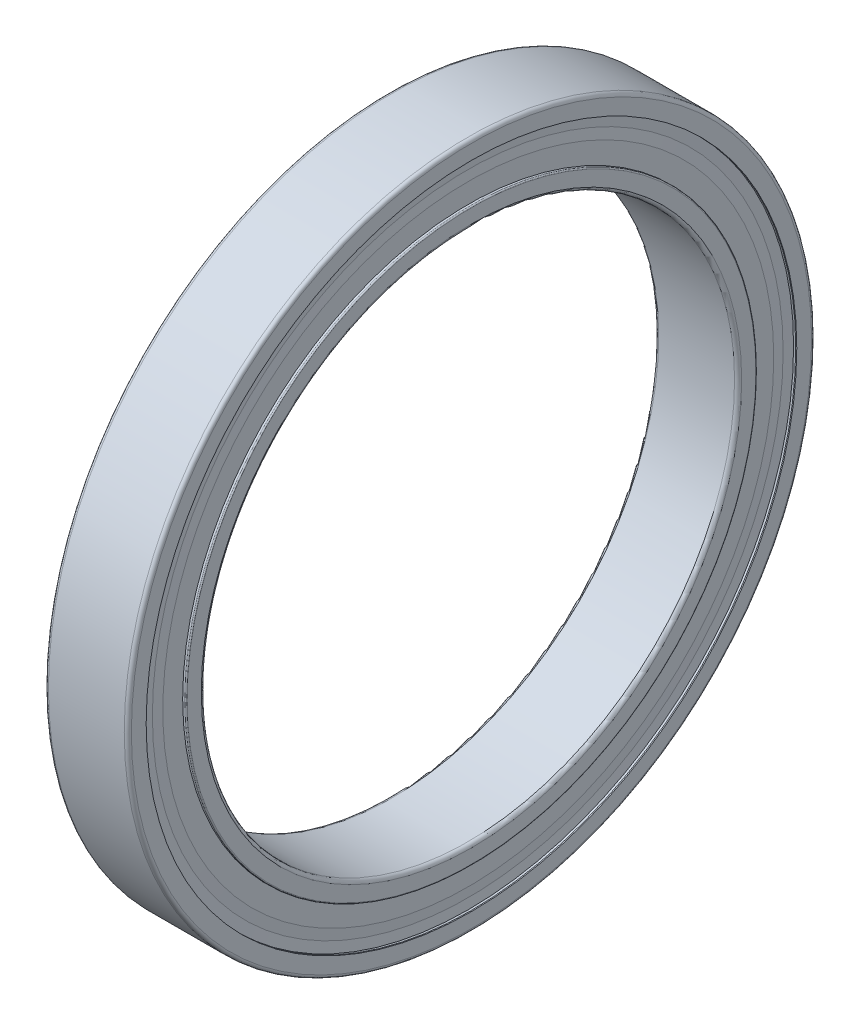
ISO-10303-21;
HEADER;
FILE_DESCRIPTION(('STEP AP214'),'2;1');
FILE_NAME('part.step','',(''),(''),'','','');
FILE_SCHEMA(('AUTOMOTIVE_DESIGN { 1 0 10303 214 1 1 1 1 }'));
ENDSEC;
DATA;
#1=APPLICATION_CONTEXT('core data for automotive mechanical design processes');
#2=APPLICATION_PROTOCOL_DEFINITION('international standard','automotive_design',2000,#1);
#3=PRODUCT_CONTEXT('',#1,'mechanical');
#4=PRODUCT('Part','Part','',(#3));
#5=PRODUCT_RELATED_PRODUCT_CATEGORY('part','',(#4));
#6=PRODUCT_DEFINITION_FORMATION('','',#4);
#7=PRODUCT_DEFINITION_CONTEXT('part definition',#1,'design');
#8=PRODUCT_DEFINITION('design','',#6,#7);
#9=PRODUCT_DEFINITION_SHAPE('','',#8);
#10=(LENGTH_UNIT() NAMED_UNIT(*) SI_UNIT(.MILLI.,.METRE.));
#11=(NAMED_UNIT(*) PLANE_ANGLE_UNIT() SI_UNIT($,.RADIAN.));
#12=(NAMED_UNIT(*) SI_UNIT($,.STERADIAN.) SOLID_ANGLE_UNIT());
#13=UNCERTAINTY_MEASURE_WITH_UNIT(LENGTH_MEASURE(1.E-05),#10,'distance_accuracy_value','');
#14=(GEOMETRIC_REPRESENTATION_CONTEXT(3) GLOBAL_UNCERTAINTY_ASSIGNED_CONTEXT((#13)) GLOBAL_UNIT_ASSIGNED_CONTEXT((#10,
#11,#12)) REPRESENTATION_CONTEXT('',''));
#15=CARTESIAN_POINT('',(0.,0.,0.));
#16=DIRECTION('',(0.,0.,1.));
#17=DIRECTION('',(1.,0.,0.));
#18=AXIS2_PLACEMENT_3D('',#15,#16,#17);
#19=CARTESIAN_POINT('',(6.64,0.,0.));
#20=DIRECTION('',(1.,0.,0.));
#21=DIRECTION('',(0.,0.,-1.));
#22=AXIS2_PLACEMENT_3D('',#19,#20,#21);
#23=CONICAL_SURFACE('',#22,27.45,1.4637444653);
#24=CARTESIAN_POINT('',(6.64,0.,0.));
#25=DIRECTION('',(1.,0.,0.));
#26=DIRECTION('',(0.,0.,-1.));
#27=AXIS2_PLACEMENT_3D('',#24,#25,#26);
#28=CIRCLE('',#27,27.45);
#29=CARTESIAN_POINT('',(6.64,0.,-27.45));
#30=VERTEX_POINT('',#29);
#31=EDGE_CURVE('P0_E39',#30,#30,#28,.T.);
#32=ORIENTED_EDGE('',*,*,#31,.F.);
#33=EDGE_LOOP('',(#32));
#34=FACE_BOUND('',#33,.T.);
#35=CARTESIAN_POINT('',(6.55,0.,0.));
#36=DIRECTION('',(1.,0.,0.));
#37=DIRECTION('',(0.,0.,-1.));
#38=AXIS2_PLACEMENT_3D('',#35,#36,#37);
#39=CIRCLE('',#38,26.6125);
#40=CARTESIAN_POINT('',(6.55,0.,-26.6125));
#41=VERTEX_POINT('',#40);
#42=EDGE_CURVE('P0_E11',#41,#41,#39,.T.);
#43=ORIENTED_EDGE('',*,*,#42,.T.);
#44=EDGE_LOOP('',(#43));
#45=FACE_BOUND('',#44,.T.);
#46=ADVANCED_FACE('P0_F16',(#34,#45),#23,.T.);
#47=CARTESIAN_POINT('',(6.55,26.6125,0.));
#48=DIRECTION('',(-1.,0.,0.));
#49=DIRECTION('',(0.,0.,1.));
#50=AXIS2_PLACEMENT_3D('',#47,#48,#49);
#51=PLANE('',#50);
#52=ORIENTED_EDGE('',*,*,#42,.F.);
#53=EDGE_LOOP('',(#52));
#54=FACE_BOUND('',#53,.T.);
#55=CARTESIAN_POINT('',(6.55,0.,0.));
#56=DIRECTION('',(1.,0.,0.));
#57=DIRECTION('',(0.,0.,-1.));
#58=AXIS2_PLACEMENT_3D('',#55,#56,#57);
#59=CIRCLE('',#58,25.775);
#60=CARTESIAN_POINT('',(6.55,0.,-25.775));
#61=VERTEX_POINT('',#60);
#62=EDGE_CURVE('P0_E27',#61,#61,#59,.T.);
#63=ORIENTED_EDGE('',*,*,#62,.T.);
#64=EDGE_LOOP('',(#63));
#65=FACE_BOUND('',#64,.T.);
#66=ADVANCED_FACE('P0_F249',(#54,#65),#51,.T.);
#67=CARTESIAN_POINT('',(0.45,0.,0.));
#68=DIRECTION('',(-1.,0.,0.));
#69=DIRECTION('',(0.,0.,1.));
#70=AXIS2_PLACEMENT_3D('',#67,#68,#69);
#71=CONICAL_SURFACE('',#70,26.6125,1.4637444653);
#72=CARTESIAN_POINT('',(0.36,0.,0.));
#73=DIRECTION('',(1.,0.,0.));
#74=DIRECTION('',(0.,0.,-1.));
#75=AXIS2_PLACEMENT_3D('',#72,#73,#74);
#76=CIRCLE('',#75,27.45);
#77=CARTESIAN_POINT('',(0.36,0.,-27.45));
#78=VERTEX_POINT('',#77);
#79=EDGE_CURVE('P0_E167',#78,#78,#76,.T.);
#80=ORIENTED_EDGE('',*,*,#79,.T.);
#81=EDGE_LOOP('',(#80));
#82=FACE_BOUND('',#81,.T.);
#83=CARTESIAN_POINT('',(0.45,0.,0.));
#84=DIRECTION('',(1.,0.,0.));
#85=DIRECTION('',(0.,0.,-1.));
#86=AXIS2_PLACEMENT_3D('',#83,#84,#85);
#87=CIRCLE('',#86,26.6125);
#88=CARTESIAN_POINT('',(0.45,0.,-26.6125));
#89=VERTEX_POINT('',#88);
#90=EDGE_CURVE('P0_E176',#89,#89,#87,.T.);
#91=ORIENTED_EDGE('',*,*,#90,.F.);
#92=EDGE_LOOP('',(#91));
#93=FACE_BOUND('',#92,.T.);
#94=ADVANCED_FACE('P0_F254',(#82,#93),#71,.T.);
#95=CARTESIAN_POINT('',(50.,0.,0.));
#96=DIRECTION('',(-1.,0.,0.));
#97=DIRECTION('',(0.,0.,-1.));
#98=AXIS2_PLACEMENT_3D('',#95,#96,#97);
#99=CYLINDRICAL_SURFACE('',#98,24.1);
#100=CARTESIAN_POINT('',(6.64,0.,0.));
#101=DIRECTION('',(1.,0.,0.));
#102=DIRECTION('',(0.,0.,-1.));
#103=AXIS2_PLACEMENT_3D('',#100,#101,#102);
#104=CIRCLE('',#103,24.1);
#105=CARTESIAN_POINT('',(6.64,0.,-24.1));
#106=VERTEX_POINT('',#105);
#107=EDGE_CURVE('P0_E149',#106,#106,#104,.T.);
#108=ORIENTED_EDGE('',*,*,#107,.F.);
#109=EDGE_LOOP('',(#108));
#110=FACE_BOUND('',#109,.T.);
#111=CARTESIAN_POINT('',(4.90649928901511,0.,0.));
#112=DIRECTION('',(1.,0.,0.));
#113=DIRECTION('',(0.,0.,-1.));
#114=AXIS2_PLACEMENT_3D('',#111,#112,#113);
#115=CIRCLE('',#114,24.1);
#116=CARTESIAN_POINT('',(4.90649928901511,0.,-24.1));
#117=VERTEX_POINT('',#116);
#118=EDGE_CURVE('P0_E163',#117,#117,#115,.T.);
#119=ORIENTED_EDGE('',*,*,#118,.T.);
#120=EDGE_LOOP('',(#119));
#121=FACE_BOUND('',#120,.T.);
#122=ADVANCED_FACE('P0_F300',(#110,#121),#99,.T.);
#123=CARTESIAN_POINT('',(50.,0.,0.));
#124=DIRECTION('',(-1.,0.,0.));
#125=DIRECTION('',(0.,0.,-1.));
#126=AXIS2_PLACEMENT_3D('',#123,#124,#125);
#127=CYLINDRICAL_SURFACE('',#126,24.1);
#128=CARTESIAN_POINT('',(0.27,0.,0.));
#129=DIRECTION('',(1.,0.,0.));
#130=DIRECTION('',(0.,0.,-1.));
#131=AXIS2_PLACEMENT_3D('',#128,#129,#130);
#132=CIRCLE('',#131,24.1);
#133=CARTESIAN_POINT('',(0.27,0.,-24.1));
#134=VERTEX_POINT('',#133);
#135=EDGE_CURVE('P0_E189',#134,#134,#132,.T.);
#136=ORIENTED_EDGE('',*,*,#135,.F.);
#137=EDGE_LOOP('',(#136));
#138=FACE_BOUND('',#137,.T.);
#139=CARTESIAN_POINT('',(0.100000000000003,0.,0.));
#140=DIRECTION('',(1.,0.,0.));
#141=DIRECTION('',(0.,0.,-1.));
#142=AXIS2_PLACEMENT_3D('',#139,#140,#141);
#143=CIRCLE('',#142,24.1);
#144=CARTESIAN_POINT('',(0.100000000000003,0.,-24.1));
#145=VERTEX_POINT('',#144);
#146=EDGE_CURVE('P0_E168',#145,#145,#143,.T.);
#147=ORIENTED_EDGE('',*,*,#146,.T.);
#148=EDGE_LOOP('',(#147));
#149=FACE_BOUND('',#148,.T.);
#150=ADVANCED_FACE('P0_F293',(#138,#149),#127,.T.);
#151=CARTESIAN_POINT('',(50.,0.,0.));
#152=DIRECTION('',(-1.,0.,0.));
#153=DIRECTION('',(0.,0.,-1.));
#154=AXIS2_PLACEMENT_3D('',#151,#152,#153);
#155=CYLINDRICAL_SURFACE('',#154,24.1);
#156=CARTESIAN_POINT('',(6.9,0.,0.));
#157=DIRECTION('',(1.,0.,0.));
#158=DIRECTION('',(0.,0.,-1.));
#159=AXIS2_PLACEMENT_3D('',#156,#157,#158);
#160=CIRCLE('',#159,24.1);
#161=CARTESIAN_POINT('',(6.9,0.,-24.1));
#162=VERTEX_POINT('',#161);
#163=EDGE_CURVE('P0_E130',#162,#162,#160,.T.);
#164=ORIENTED_EDGE('',*,*,#163,.F.);
#165=EDGE_LOOP('',(#164));
#166=FACE_BOUND('',#165,.T.);
#167=CARTESIAN_POINT('',(6.73,0.,0.));
#168=DIRECTION('',(1.,0.,0.));
#169=DIRECTION('',(0.,0.,-1.));
#170=AXIS2_PLACEMENT_3D('',#167,#168,#169);
#171=CIRCLE('',#170,24.1);
#172=CARTESIAN_POINT('',(6.73,0.,-24.1));
#173=VERTEX_POINT('',#172);
#174=EDGE_CURVE('P0_E142',#173,#173,#171,.T.);
#175=ORIENTED_EDGE('',*,*,#174,.T.);
#176=EDGE_LOOP('',(#175));
#177=FACE_BOUND('',#176,.T.);
#178=ADVANCED_FACE('P0_F131',(#166,#177),#155,.T.);
#179=CARTESIAN_POINT('',(3.5,0.,0.));
#180=DIRECTION('',(1.,0.,0.));
#181=DIRECTION('',(0.,0.,-1.));
#182=AXIS2_PLACEMENT_3D('',#179,#180,#181);
#183=TOROIDAL_SURFACE('',#182,25.5,1.9845);
#184=CARTESIAN_POINT('',(2.09350071098489,0.,0.));
#185=DIRECTION('',(1.,0.,0.));
#186=DIRECTION('',(0.,0.,-1.));
#187=AXIS2_PLACEMENT_3D('',#184,#185,#186);
#188=CIRCLE('',#187,24.1);
#189=CARTESIAN_POINT('',(2.09350071098489,0.,-24.1));
#190=VERTEX_POINT('',#189);
#191=EDGE_CURVE('P0_E135',#190,#190,#188,.T.);
#192=ORIENTED_EDGE('',*,*,#191,.T.);
#193=EDGE_LOOP('',(#192));
#194=FACE_BOUND('',#193,.T.);
#195=ORIENTED_EDGE('',*,*,#118,.F.);
#196=EDGE_LOOP('',(#195));
#197=FACE_BOUND('',#196,.T.);
#198=ADVANCED_FACE('P0_F243',(#194,#197),#183,.F.);
#199=CARTESIAN_POINT('',(6.9,0.,0.));
#200=DIRECTION('',(1.,0.,0.));
#201=DIRECTION('',(0.,0.,-1.));
#202=AXIS2_PLACEMENT_3D('',#199,#200,#201);
#203=TOROIDAL_SURFACE('',#202,24.,0.1);
#204=CARTESIAN_POINT('',(7.,0.,0.));
#205=DIRECTION('',(1.,0.,0.));
#206=DIRECTION('',(0.,0.,-1.));
#207=AXIS2_PLACEMENT_3D('',#204,#205,#206);
#208=CIRCLE('',#207,24.);
#209=CARTESIAN_POINT('',(7.,0.,-24.));
#210=VERTEX_POINT('',#209);
#211=EDGE_CURVE('P0_E136',#210,#210,#208,.T.);
#212=ORIENTED_EDGE('',*,*,#211,.F.);
#213=EDGE_LOOP('',(#212));
#214=FACE_BOUND('',#213,.T.);
#215=ORIENTED_EDGE('',*,*,#163,.T.);
#216=EDGE_LOOP('',(#215));
#217=FACE_BOUND('',#216,.T.);
#218=ADVANCED_FACE('P0_F232',(#214,#217),#203,.T.);
#219=CARTESIAN_POINT('',(7.,22.8,0.));
#220=DIRECTION('',(1.,0.,0.));
#221=DIRECTION('',(0.,1.,0.));
#222=AXIS2_PLACEMENT_3D('',#219,#220,#221);
#223=PLANE('',#222);
#224=ORIENTED_EDGE('',*,*,#211,.T.);
#225=EDGE_LOOP('',(#224));
#226=FACE_BOUND('',#225,.T.);
#227=CARTESIAN_POINT('',(7.,0.,0.));
#228=DIRECTION('',(1.,0.,0.));
#229=DIRECTION('',(0.,0.,-1.));
#230=AXIS2_PLACEMENT_3D('',#227,#228,#229);
#231=CIRCLE('',#230,22.8);
#232=CARTESIAN_POINT('',(7.,0.,-22.8));
#233=VERTEX_POINT('',#232);
#234=EDGE_CURVE('P0_E146',#233,#233,#231,.T.);
#235=ORIENTED_EDGE('',*,*,#234,.F.);
#236=EDGE_LOOP('',(#235));
#237=FACE_BOUND('',#236,.T.);
#238=ADVANCED_FACE('P0_F230',(#226,#237),#223,.T.);
#239=CARTESIAN_POINT('',(6.7,0.,0.));
#240=DIRECTION('',(1.,0.,0.));
#241=DIRECTION('',(0.,0.,-1.));
#242=AXIS2_PLACEMENT_3D('',#239,#240,#241);
#243=TOROIDAL_SURFACE('',#242,22.8,0.3);
#244=CARTESIAN_POINT('',(6.7,0.,0.));
#245=DIRECTION('',(1.,0.,0.));
#246=DIRECTION('',(0.,0.,-1.));
#247=AXIS2_PLACEMENT_3D('',#244,#245,#246);
#248=CIRCLE('',#247,22.5);
#249=CARTESIAN_POINT('',(6.7,0.,-22.5));
#250=VERTEX_POINT('',#249);
#251=EDGE_CURVE('P0_E154',#250,#250,#248,.T.);
#252=ORIENTED_EDGE('',*,*,#251,.F.);
#253=EDGE_LOOP('',(#252));
#254=FACE_BOUND('',#253,.T.);
#255=ORIENTED_EDGE('',*,*,#234,.T.);
#256=EDGE_LOOP('',(#255));
#257=FACE_BOUND('',#256,.T.);
#258=ADVANCED_FACE('P0_F228',(#254,#257),#243,.T.);
#259=CARTESIAN_POINT('',(50.,0.,0.));
#260=DIRECTION('',(-1.,0.,0.));
#261=DIRECTION('',(0.,0.,-1.));
#262=AXIS2_PLACEMENT_3D('',#259,#260,#261);
#263=CYLINDRICAL_SURFACE('',#262,22.5);
#264=CARTESIAN_POINT('',(0.3,0.,0.));
#265=DIRECTION('',(1.,0.,0.));
#266=DIRECTION('',(0.,0.,-1.));
#267=AXIS2_PLACEMENT_3D('',#264,#265,#266);
#268=CIRCLE('',#267,22.5);
#269=CARTESIAN_POINT('',(0.3,0.,-22.5));
#270=VERTEX_POINT('',#269);
#271=EDGE_CURVE('P0_E158',#270,#270,#268,.T.);
#272=ORIENTED_EDGE('',*,*,#271,.F.);
#273=EDGE_LOOP('',(#272));
#274=FACE_BOUND('',#273,.T.);
#275=ORIENTED_EDGE('',*,*,#251,.T.);
#276=EDGE_LOOP('',(#275));
#277=FACE_BOUND('',#276,.T.);
#278=ADVANCED_FACE('P0_F240',(#274,#277),#263,.F.);
#279=CARTESIAN_POINT('',(0.3,0.,0.));
#280=DIRECTION('',(1.,0.,0.));
#281=DIRECTION('',(0.,0.,-1.));
#282=AXIS2_PLACEMENT_3D('',#279,#280,#281);
#283=TOROIDAL_SURFACE('',#282,22.8,0.3);
#284=CARTESIAN_POINT('',(0.,0.,0.));
#285=DIRECTION('',(1.,0.,0.));
#286=DIRECTION('',(0.,0.,-1.));
#287=AXIS2_PLACEMENT_3D('',#284,#285,#286);
#288=CIRCLE('',#287,22.8);
#289=CARTESIAN_POINT('',(0.,0.,-22.8));
#290=VERTEX_POINT('',#289);
#291=EDGE_CURVE('P0_E162',#290,#290,#288,.T.);
#292=ORIENTED_EDGE('',*,*,#291,.F.);
#293=EDGE_LOOP('',(#292));
#294=FACE_BOUND('',#293,.T.);
#295=ORIENTED_EDGE('',*,*,#271,.T.);
#296=EDGE_LOOP('',(#295));
#297=FACE_BOUND('',#296,.T.);
#298=ADVANCED_FACE('P0_F259',(#294,#297),#283,.T.);
#299=CARTESIAN_POINT('',(0.,24.,0.));
#300=DIRECTION('',(-1.,0.,0.));
#301=DIRECTION('',(0.,0.,1.));
#302=AXIS2_PLACEMENT_3D('',#299,#300,#301);
#303=PLANE('',#302);
#304=CARTESIAN_POINT('',(0.,0.,0.));
#305=DIRECTION('',(1.,0.,0.));
#306=DIRECTION('',(0.,0.,-1.));
#307=AXIS2_PLACEMENT_3D('',#304,#305,#306);
#308=CIRCLE('',#307,24.);
#309=CARTESIAN_POINT('',(0.,0.,-24.));
#310=VERTEX_POINT('',#309);
#311=EDGE_CURVE('P0_E20',#310,#310,#308,.T.);
#312=ORIENTED_EDGE('',*,*,#311,.F.);
#313=EDGE_LOOP('',(#312));
#314=FACE_BOUND('',#313,.T.);
#315=ORIENTED_EDGE('',*,*,#291,.T.);
#316=EDGE_LOOP('',(#315));
#317=FACE_BOUND('',#316,.T.);
#318=ADVANCED_FACE('P0_F18',(#314,#317),#303,.T.);
#319=CARTESIAN_POINT('',(0.100000000000007,0.,0.));
#320=DIRECTION('',(1.,0.,0.));
#321=DIRECTION('',(0.,0.,-1.));
#322=AXIS2_PLACEMENT_3D('',#319,#320,#321);
#323=TOROIDAL_SURFACE('',#322,24.,0.1);
#324=ORIENTED_EDGE('',*,*,#146,.F.);
#325=EDGE_LOOP('',(#324));
#326=FACE_BOUND('',#325,.T.);
#327=ORIENTED_EDGE('',*,*,#311,.T.);
#328=EDGE_LOOP('',(#327));
#329=FACE_BOUND('',#328,.T.);
#330=ADVANCED_FACE('P0_F340',(#326,#329),#323,.T.);
#331=CARTESIAN_POINT('',(0.27,25.775,0.));
#332=DIRECTION('',(-1.,0.,0.));
#333=DIRECTION('',(0.,0.,1.));
#334=AXIS2_PLACEMENT_3D('',#331,#332,#333);
#335=PLANE('',#334);
#336=CARTESIAN_POINT('',(0.27,0.,0.));
#337=DIRECTION('',(1.,0.,0.));
#338=DIRECTION('',(0.,0.,-1.));
#339=AXIS2_PLACEMENT_3D('',#336,#337,#338);
#340=CIRCLE('',#339,25.775);
#341=CARTESIAN_POINT('',(0.27,0.,-25.775));
#342=VERTEX_POINT('',#341);
#343=EDGE_CURVE('P0_E185',#342,#342,#340,.T.);
#344=ORIENTED_EDGE('',*,*,#343,.F.);
#345=EDGE_LOOP('',(#344));
#346=FACE_BOUND('',#345,.T.);
#347=ORIENTED_EDGE('',*,*,#135,.T.);
#348=EDGE_LOOP('',(#347));
#349=FACE_BOUND('',#348,.T.);
#350=ADVANCED_FACE('P0_F266',(#346,#349),#335,.T.);
#351=CARTESIAN_POINT('',(0.315,0.,0.));
#352=DIRECTION('',(1.,0.,0.));
#353=DIRECTION('',(0.,0.,-1.));
#354=AXIS2_PLACEMENT_3D('',#351,#352,#353);
#355=CONICAL_SURFACE('',#354,26.6125,1.5171166026);
#356=CARTESIAN_POINT('',(0.315,0.,0.));
#357=DIRECTION('',(1.,0.,0.));
#358=DIRECTION('',(0.,0.,-1.));
#359=AXIS2_PLACEMENT_3D('',#356,#357,#358);
#360=CIRCLE('',#359,26.6125);
#361=CARTESIAN_POINT('',(0.315,0.,-26.6125));
#362=VERTEX_POINT('',#361);
#363=EDGE_CURVE('P0_E181',#362,#362,#360,.T.);
#364=ORIENTED_EDGE('',*,*,#363,.F.);
#365=EDGE_LOOP('',(#364));
#366=FACE_BOUND('',#365,.T.);
#367=ORIENTED_EDGE('',*,*,#343,.T.);
#368=EDGE_LOOP('',(#367));
#369=FACE_BOUND('',#368,.T.);
#370=ADVANCED_FACE('P0_F262',(#366,#369),#355,.T.);
#371=CARTESIAN_POINT('',(0.27,0.,0.));
#372=DIRECTION('',(-1.,0.,0.));
#373=DIRECTION('',(0.,0.,1.));
#374=AXIS2_PLACEMENT_3D('',#371,#372,#373);
#375=CONICAL_SURFACE('',#374,27.45,1.5171166026);
#376=CARTESIAN_POINT('',(0.27,0.,0.));
#377=DIRECTION('',(1.,0.,0.));
#378=DIRECTION('',(0.,0.,-1.));
#379=AXIS2_PLACEMENT_3D('',#376,#377,#378);
#380=CIRCLE('',#379,27.45);
#381=CARTESIAN_POINT('',(0.27,0.,-27.45));
#382=VERTEX_POINT('',#381);
#383=EDGE_CURVE('P0_E178',#382,#382,#380,.T.);
#384=ORIENTED_EDGE('',*,*,#383,.F.);
#385=EDGE_LOOP('',(#384));
#386=FACE_BOUND('',#385,.T.);
#387=ORIENTED_EDGE('',*,*,#363,.T.);
#388=EDGE_LOOP('',(#387));
#389=FACE_BOUND('',#388,.T.);
#390=ADVANCED_FACE('P0_F265',(#386,#389),#375,.F.);
#391=CARTESIAN_POINT('',(50.,0.,0.));
#392=DIRECTION('',(-1.,0.,0.));
#393=DIRECTION('',(0.,0.,-1.));
#394=AXIS2_PLACEMENT_3D('',#391,#392,#393);
#395=CYLINDRICAL_SURFACE('',#394,27.45);
#396=ORIENTED_EDGE('',*,*,#79,.F.);
#397=EDGE_LOOP('',(#396));
#398=FACE_BOUND('',#397,.T.);
#399=ORIENTED_EDGE('',*,*,#383,.T.);
#400=EDGE_LOOP('',(#399));
#401=FACE_BOUND('',#400,.T.);
#402=ADVANCED_FACE('P0_F272',(#398,#401),#395,.T.);
#403=CARTESIAN_POINT('',(0.45,25.775,0.));
#404=DIRECTION('',(1.,0.,0.));
#405=DIRECTION('',(0.,1.,0.));
#406=AXIS2_PLACEMENT_3D('',#403,#404,#405);
#407=PLANE('',#406);
#408=ORIENTED_EDGE('',*,*,#90,.T.);
#409=EDGE_LOOP('',(#408));
#410=FACE_BOUND('',#409,.T.);
#411=CARTESIAN_POINT('',(0.45,0.,0.));
#412=DIRECTION('',(1.,0.,0.));
#413=DIRECTION('',(0.,0.,-1.));
#414=AXIS2_PLACEMENT_3D('',#411,#412,#413);
#415=CIRCLE('',#414,25.775);
#416=CARTESIAN_POINT('',(0.45,0.,-25.775));
#417=VERTEX_POINT('',#416);
#418=EDGE_CURVE('P0_E172',#417,#417,#415,.T.);
#419=ORIENTED_EDGE('',*,*,#418,.F.);
#420=EDGE_LOOP('',(#419));
#421=FACE_BOUND('',#420,.T.);
#422=ADVANCED_FACE('P0_F268',(#410,#421),#407,.T.);
#423=CARTESIAN_POINT('',(0.36,0.,0.));
#424=DIRECTION('',(1.,0.,0.));
#425=DIRECTION('',(0.,0.,-1.));
#426=AXIS2_PLACEMENT_3D('',#423,#424,#425);
#427=CONICAL_SURFACE('',#426,24.1,1.5171166026);
#428=ORIENTED_EDGE('',*,*,#418,.T.);
#429=EDGE_LOOP('',(#428));
#430=FACE_BOUND('',#429,.T.);
#431=CARTESIAN_POINT('',(0.36,0.,0.));
#432=DIRECTION('',(1.,0.,0.));
#433=DIRECTION('',(0.,0.,-1.));
#434=AXIS2_PLACEMENT_3D('',#431,#432,#433);
#435=CIRCLE('',#434,24.1);
#436=CARTESIAN_POINT('',(0.36,0.,-24.1));
#437=VERTEX_POINT('',#436);
#438=EDGE_CURVE('P0_E177',#437,#437,#435,.T.);
#439=ORIENTED_EDGE('',*,*,#438,.F.);
#440=EDGE_LOOP('',(#439));
#441=FACE_BOUND('',#440,.T.);
#442=ADVANCED_FACE('P0_F271',(#430,#441),#427,.F.);
#443=CARTESIAN_POINT('',(50.,0.,0.));
#444=DIRECTION('',(-1.,0.,0.));
#445=DIRECTION('',(0.,0.,-1.));
#446=AXIS2_PLACEMENT_3D('',#443,#444,#445);
#447=CYLINDRICAL_SURFACE('',#446,24.1);
#448=ORIENTED_EDGE('',*,*,#191,.F.);
#449=EDGE_LOOP('',(#448));
#450=FACE_BOUND('',#449,.T.);
#451=ORIENTED_EDGE('',*,*,#438,.T.);
#452=EDGE_LOOP('',(#451));
#453=FACE_BOUND('',#452,.T.);
#454=ADVANCED_FACE('P0_F275',(#450,#453),#447,.T.);
#455=CARTESIAN_POINT('',(6.73,24.1,0.));
#456=DIRECTION('',(1.,0.,0.));
#457=DIRECTION('',(0.,1.,0.));
#458=AXIS2_PLACEMENT_3D('',#455,#456,#457);
#459=PLANE('',#458);
#460=CARTESIAN_POINT('',(6.73,0.,0.));
#461=DIRECTION('',(1.,0.,0.));
#462=DIRECTION('',(0.,0.,-1.));
#463=AXIS2_PLACEMENT_3D('',#460,#461,#462);
#464=CIRCLE('',#463,25.775);
#465=CARTESIAN_POINT('',(6.73,0.,-25.775));
#466=VERTEX_POINT('',#465);
#467=EDGE_CURVE('P0_E205',#466,#466,#464,.T.);
#468=ORIENTED_EDGE('',*,*,#467,.T.);
#469=EDGE_LOOP('',(#468));
#470=FACE_BOUND('',#469,.T.);
#471=ORIENTED_EDGE('',*,*,#174,.F.);
#472=EDGE_LOOP('',(#471));
#473=FACE_BOUND('',#472,.T.);
#474=ADVANCED_FACE('P0_F277',(#470,#473),#459,.T.);
#475=CARTESIAN_POINT('',(6.73,0.,0.));
#476=DIRECTION('',(-1.,0.,0.));
#477=DIRECTION('',(0.,0.,1.));
#478=AXIS2_PLACEMENT_3D('',#475,#476,#477);
#479=CONICAL_SURFACE('',#478,25.775,1.5171166026);
#480=CARTESIAN_POINT('',(6.685,0.,0.));
#481=DIRECTION('',(1.,0.,0.));
#482=DIRECTION('',(0.,0.,-1.));
#483=AXIS2_PLACEMENT_3D('',#480,#481,#482);
#484=CIRCLE('',#483,26.6125);
#485=CARTESIAN_POINT('',(6.685,0.,-26.6125));
#486=VERTEX_POINT('',#485);
#487=EDGE_CURVE('P0_E152',#486,#486,#484,.T.);
#488=ORIENTED_EDGE('',*,*,#487,.T.);
#489=EDGE_LOOP('',(#488));
#490=FACE_BOUND('',#489,.T.);
#491=ORIENTED_EDGE('',*,*,#467,.F.);
#492=EDGE_LOOP('',(#491));
#493=FACE_BOUND('',#492,.T.);
#494=ADVANCED_FACE('P0_F279',(#490,#493),#479,.T.);
#495=CARTESIAN_POINT('',(6.55,0.,0.));
#496=DIRECTION('',(-1.,0.,0.));
#497=DIRECTION('',(0.,0.,1.));
#498=AXIS2_PLACEMENT_3D('',#495,#496,#497);
#499=CONICAL_SURFACE('',#498,25.775,1.5171166026);
#500=ORIENTED_EDGE('',*,*,#62,.F.);
#501=EDGE_LOOP('',(#500));
#502=FACE_BOUND('',#501,.T.);
#503=ORIENTED_EDGE('',*,*,#107,.T.);
#504=EDGE_LOOP('',(#503));
#505=FACE_BOUND('',#504,.T.);
#506=ADVANCED_FACE('P0_F285',(#502,#505),#499,.F.);
#507=CARTESIAN_POINT('',(6.685,0.,0.));
#508=DIRECTION('',(1.,0.,0.));
#509=DIRECTION('',(0.,0.,-1.));
#510=AXIS2_PLACEMENT_3D('',#507,#508,#509);
#511=CONICAL_SURFACE('',#510,26.6125,1.5171166026);
#512=CARTESIAN_POINT('',(6.73,0.,0.));
#513=DIRECTION('',(1.,0.,0.));
#514=DIRECTION('',(0.,0.,-1.));
#515=AXIS2_PLACEMENT_3D('',#512,#513,#514);
#516=CIRCLE('',#515,27.45);
#517=CARTESIAN_POINT('',(6.73,0.,-27.45));
#518=VERTEX_POINT('',#517);
#519=EDGE_CURVE('P0_E153',#518,#518,#516,.T.);
#520=ORIENTED_EDGE('',*,*,#519,.T.);
#521=EDGE_LOOP('',(#520));
#522=FACE_BOUND('',#521,.T.);
#523=ORIENTED_EDGE('',*,*,#487,.F.);
#524=EDGE_LOOP('',(#523));
#525=FACE_BOUND('',#524,.T.);
#526=ADVANCED_FACE('P0_F306',(#522,#525),#511,.F.);
#527=CARTESIAN_POINT('',(50.,0.,0.));
#528=DIRECTION('',(-1.,0.,0.));
#529=DIRECTION('',(0.,0.,-1.));
#530=AXIS2_PLACEMENT_3D('',#527,#528,#529);
#531=CYLINDRICAL_SURFACE('',#530,27.45);
#532=ORIENTED_EDGE('',*,*,#519,.F.);
#533=EDGE_LOOP('',(#532));
#534=FACE_BOUND('',#533,.T.);
#535=ORIENTED_EDGE('',*,*,#31,.T.);
#536=EDGE_LOOP('',(#535));
#537=FACE_BOUND('',#536,.T.);
#538=ADVANCED_FACE('P0_F308',(#534,#537),#531,.T.);
#539=CLOSED_SHELL('',(#46,#66,#94,#122,#150,#178,#198,#218,#238,#258,#278,#298,#318,#330,#350,
#370,#390,#402,#422,#442,#454,#474,#494,#506,#526,#538));
#540=MANIFOLD_SOLID_BREP('P0_B1',#539);
#541=CARTESIAN_POINT('',(0.,28.7,0.));
#542=DIRECTION('',(-1.,0.,0.));
#543=DIRECTION('',(0.,0.,1.));
#544=AXIS2_PLACEMENT_3D('',#541,#542,#543);
#545=PLANE('',#544);
#546=CARTESIAN_POINT('',(0.,0.,0.));
#547=DIRECTION('',(1.,0.,0.));
#548=DIRECTION('',(0.,0.,-1.));
#549=AXIS2_PLACEMENT_3D('',#546,#547,#548);
#550=CIRCLE('',#549,28.7);
#551=CARTESIAN_POINT('',(0.,0.,-28.7));
#552=VERTEX_POINT('',#551);
#553=EDGE_CURVE('P1_E39',#552,#552,#550,.T.);
#554=ORIENTED_EDGE('',*,*,#553,.F.);
#555=EDGE_LOOP('',(#554));
#556=FACE_BOUND('',#555,.T.);
#557=CARTESIAN_POINT('',(0.,0.,0.));
#558=DIRECTION('',(1.,0.,0.));
#559=DIRECTION('',(0.,0.,-1.));
#560=AXIS2_PLACEMENT_3D('',#557,#558,#559);
#561=CIRCLE('',#560,27.45);
#562=CARTESIAN_POINT('',(0.,0.,-27.45));
#563=VERTEX_POINT('',#562);
#564=EDGE_CURVE('P1_E11',#563,#563,#561,.T.);
#565=ORIENTED_EDGE('',*,*,#564,.T.);
#566=EDGE_LOOP('',(#565));
#567=FACE_BOUND('',#566,.T.);
#568=ADVANCED_FACE('P1_F16',(#556,#567),#545,.T.);
#569=CARTESIAN_POINT('',(50.,0.,0.));
#570=DIRECTION('',(-1.,0.,0.));
#571=DIRECTION('',(0.,0.,-1.));
#572=AXIS2_PLACEMENT_3D('',#569,#570,#571);
#573=CYLINDRICAL_SURFACE('',#572,27.45);
#574=ORIENTED_EDGE('',*,*,#564,.F.);
#575=EDGE_LOOP('',(#574));
#576=FACE_BOUND('',#575,.T.);
#577=CARTESIAN_POINT('',(0.09,0.,0.));
#578=DIRECTION('',(1.,0.,0.));
#579=DIRECTION('',(0.,0.,-1.));
#580=AXIS2_PLACEMENT_3D('',#577,#578,#579);
#581=CIRCLE('',#580,27.45);
#582=CARTESIAN_POINT('',(0.09,0.,-27.45));
#583=VERTEX_POINT('',#582);
#584=EDGE_CURVE('P1_E27',#583,#583,#581,.T.);
#585=ORIENTED_EDGE('',*,*,#584,.T.);
#586=EDGE_LOOP('',(#585));
#587=FACE_BOUND('',#586,.T.);
#588=ADVANCED_FACE('P1_F170',(#576,#587),#573,.F.);
#589=CARTESIAN_POINT('',(0.27,0.,0.));
#590=DIRECTION('',(1.,0.,0.));
#591=DIRECTION('',(0.,0.,-1.));
#592=AXIS2_PLACEMENT_3D('',#589,#590,#591);
#593=TOROIDAL_SURFACE('',#592,27.45,0.18);
#594=CARTESIAN_POINT('',(0.45,0.,0.));
#595=DIRECTION('',(1.,0.,0.));
#596=DIRECTION('',(0.,0.,-1.));
#597=AXIS2_PLACEMENT_3D('',#594,#595,#596);
#598=CIRCLE('',#597,27.45);
#599=CARTESIAN_POINT('',(0.45,0.,-27.45));
#600=VERTEX_POINT('',#599);
#601=EDGE_CURVE('P1_E113',#600,#600,#598,.T.);
#602=ORIENTED_EDGE('',*,*,#601,.T.);
#603=EDGE_LOOP('',(#602));
#604=FACE_BOUND('',#603,.T.);
#605=ORIENTED_EDGE('',*,*,#584,.F.);
#606=EDGE_LOOP('',(#605));
#607=FACE_BOUND('',#606,.T.);
#608=CARTESIAN_POINT('',(0.27,0.,-27.63));
#609=VERTEX_POINT('',#608);
#610=VERTEX_LOOP('',#609);
#611=FACE_BOUND('',#610,.T.);
#612=ADVANCED_FACE('P1_F175',(#604,#607,#611),#593,.F.);
#613=CARTESIAN_POINT('',(0.45,0.,0.));
#614=DIRECTION('',(-1.,0.,0.));
#615=DIRECTION('',(0.,0.,1.));
#616=AXIS2_PLACEMENT_3D('',#613,#614,#615);
#617=CONICAL_SURFACE('',#616,27.45,1.3962634016);
#618=ORIENTED_EDGE('',*,*,#601,.F.);
#619=EDGE_LOOP('',(#618));
#620=FACE_BOUND('',#619,.T.);
#621=CARTESIAN_POINT('',(0.559322728039248,0.,0.));
#622=DIRECTION('',(1.,0.,0.));
#623=DIRECTION('',(0.,0.,-1.));
#624=AXIS2_PLACEMENT_3D('',#621,#622,#623);
#625=CIRCLE('',#624,26.83);
#626=CARTESIAN_POINT('',(0.559322728039248,0.,-26.83));
#627=VERTEX_POINT('',#626);
#628=EDGE_CURVE('P1_E110',#627,#627,#625,.T.);
#629=ORIENTED_EDGE('',*,*,#628,.T.);
#630=EDGE_LOOP('',(#629));
#631=FACE_BOUND('',#630,.T.);
#632=ADVANCED_FACE('P1_F190',(#620,#631),#617,.F.);
#633=CARTESIAN_POINT('',(50.,0.,0.));
#634=DIRECTION('',(-1.,0.,0.));
#635=DIRECTION('',(0.,0.,-1.));
#636=AXIS2_PLACEMENT_3D('',#633,#634,#635);
#637=CYLINDRICAL_SURFACE('',#636,26.83);
#638=ORIENTED_EDGE('',*,*,#628,.F.);
#639=EDGE_LOOP('',(#638));
#640=FACE_BOUND('',#639,.T.);
#641=CARTESIAN_POINT('',(2.02713196449919,0.,0.));
#642=DIRECTION('',(1.,0.,0.));
#643=DIRECTION('',(0.,0.,-1.));
#644=AXIS2_PLACEMENT_3D('',#641,#642,#643);
#645=CIRCLE('',#644,26.83);
#646=CARTESIAN_POINT('',(2.02713196449919,0.,-26.83));
#647=VERTEX_POINT('',#646);
#648=EDGE_CURVE('P1_E114',#647,#647,#645,.T.);
#649=ORIENTED_EDGE('',*,*,#648,.T.);
#650=EDGE_LOOP('',(#649));
#651=FACE_BOUND('',#650,.T.);
#652=ADVANCED_FACE('P1_F18',(#640,#651),#637,.F.);
#653=CARTESIAN_POINT('',(3.5,0.,0.));
#654=DIRECTION('',(1.,0.,0.));
#655=DIRECTION('',(0.,0.,-1.));
#656=AXIS2_PLACEMENT_3D('',#653,#654,#655);
#657=TOROIDAL_SURFACE('',#656,25.5,1.9845);
#658=CARTESIAN_POINT('',(4.97286803550081,0.,0.));
#659=DIRECTION('',(1.,0.,0.));
#660=DIRECTION('',(0.,0.,-1.));
#661=AXIS2_PLACEMENT_3D('',#658,#659,#660);
#662=CIRCLE('',#661,26.83);
#663=CARTESIAN_POINT('',(4.97286803550081,0.,-26.83));
#664=VERTEX_POINT('',#663);
#665=EDGE_CURVE('P1_E118',#664,#664,#662,.T.);
#666=ORIENTED_EDGE('',*,*,#665,.T.);
#667=EDGE_LOOP('',(#666));
#668=FACE_BOUND('',#667,.T.);
#669=ORIENTED_EDGE('',*,*,#648,.F.);
#670=EDGE_LOOP('',(#669));
#671=FACE_BOUND('',#670,.T.);
#672=CARTESIAN_POINT('',(3.5,0.,-27.4845));
#673=VERTEX_POINT('',#672);
#674=VERTEX_LOOP('',#673);
#675=FACE_BOUND('',#674,.T.);
#676=ADVANCED_FACE('P1_F185',(#668,#671,#675),#657,.F.);
#677=CARTESIAN_POINT('',(50.,0.,0.));
#678=DIRECTION('',(-1.,0.,0.));
#679=DIRECTION('',(0.,0.,-1.));
#680=AXIS2_PLACEMENT_3D('',#677,#678,#679);
#681=CYLINDRICAL_SURFACE('',#680,26.83);
#682=ORIENTED_EDGE('',*,*,#665,.F.);
#683=EDGE_LOOP('',(#682));
#684=FACE_BOUND('',#683,.T.);
#685=CARTESIAN_POINT('',(6.44067727196075,0.,0.));
#686=DIRECTION('',(1.,0.,0.));
#687=DIRECTION('',(0.,0.,-1.));
#688=AXIS2_PLACEMENT_3D('',#685,#686,#687);
#689=CIRCLE('',#688,26.83);
#690=CARTESIAN_POINT('',(6.44067727196075,0.,-26.83));
#691=VERTEX_POINT('',#690);
#692=EDGE_CURVE('P1_E105',#691,#691,#689,.T.);
#693=ORIENTED_EDGE('',*,*,#692,.T.);
#694=EDGE_LOOP('',(#693));
#695=FACE_BOUND('',#694,.T.);
#696=ADVANCED_FACE('P1_F182',(#684,#695),#681,.F.);
#697=CARTESIAN_POINT('',(6.44067727196075,0.,0.));
#698=DIRECTION('',(1.,0.,0.));
#699=DIRECTION('',(0.,0.,-1.));
#700=AXIS2_PLACEMENT_3D('',#697,#698,#699);
#701=CONICAL_SURFACE('',#700,26.83,1.3962634016);
#702=CARTESIAN_POINT('',(6.55,0.,0.));
#703=DIRECTION('',(1.,0.,0.));
#704=DIRECTION('',(0.,0.,-1.));
#705=AXIS2_PLACEMENT_3D('',#702,#703,#704);
#706=CIRCLE('',#705,27.45);
#707=CARTESIAN_POINT('',(6.55,0.,-27.45));
#708=VERTEX_POINT('',#707);
#709=EDGE_CURVE('P1_E99',#708,#708,#706,.T.);
#710=ORIENTED_EDGE('',*,*,#709,.T.);
#711=EDGE_LOOP('',(#710));
#712=FACE_BOUND('',#711,.T.);
#713=ORIENTED_EDGE('',*,*,#692,.F.);
#714=EDGE_LOOP('',(#713));
#715=FACE_BOUND('',#714,.T.);
#716=ADVANCED_FACE('P1_F184',(#712,#715),#701,.F.);
#717=CARTESIAN_POINT('',(6.73,0.,0.));
#718=DIRECTION('',(1.,0.,0.));
#719=DIRECTION('',(0.,0.,-1.));
#720=AXIS2_PLACEMENT_3D('',#717,#718,#719);
#721=TOROIDAL_SURFACE('',#720,27.4500000095,0.18);
#722=CARTESIAN_POINT('',(6.91,0.,0.));
#723=DIRECTION('',(1.,0.,0.));
#724=DIRECTION('',(0.,0.,-1.));
#725=AXIS2_PLACEMENT_3D('',#722,#723,#724);
#726=CIRCLE('',#725,27.45);
#727=CARTESIAN_POINT('',(6.91,0.,-27.45));
#728=VERTEX_POINT('',#727);
#729=EDGE_CURVE('P1_E94',#728,#728,#726,.T.);
#730=ORIENTED_EDGE('',*,*,#729,.T.);
#731=EDGE_LOOP('',(#730));
#732=FACE_BOUND('',#731,.T.);
#733=ORIENTED_EDGE('',*,*,#709,.F.);
#734=EDGE_LOOP('',(#733));
#735=FACE_BOUND('',#734,.T.);
#736=CARTESIAN_POINT('',(6.73,0.,-27.6300000094977));
#737=VERTEX_POINT('',#736);
#738=VERTEX_LOOP('',#737);
#739=FACE_BOUND('',#738,.T.);
#740=ADVANCED_FACE('P1_F181',(#732,#735,#739),#721,.F.);
#741=CARTESIAN_POINT('',(50.,0.,0.));
#742=DIRECTION('',(-1.,0.,0.));
#743=DIRECTION('',(0.,0.,-1.));
#744=AXIS2_PLACEMENT_3D('',#741,#742,#743);
#745=CYLINDRICAL_SURFACE('',#744,27.45);
#746=ORIENTED_EDGE('',*,*,#729,.F.);
#747=EDGE_LOOP('',(#746));
#748=FACE_BOUND('',#747,.T.);
#749=CARTESIAN_POINT('',(7.,0.,0.));
#750=DIRECTION('',(1.,0.,0.));
#751=DIRECTION('',(0.,0.,-1.));
#752=AXIS2_PLACEMENT_3D('',#749,#750,#751);
#753=CIRCLE('',#752,27.45);
#754=CARTESIAN_POINT('',(7.,0.,-27.45));
#755=VERTEX_POINT('',#754);
#756=EDGE_CURVE('P1_E20',#755,#755,#753,.T.);
#757=ORIENTED_EDGE('',*,*,#756,.T.);
#758=EDGE_LOOP('',(#757));
#759=FACE_BOUND('',#758,.T.);
#760=ADVANCED_FACE('P1_F95',(#748,#759),#745,.F.);
#761=CARTESIAN_POINT('',(7.,27.45,0.));
#762=DIRECTION('',(1.,0.,0.));
#763=DIRECTION('',(0.,1.,0.));
#764=AXIS2_PLACEMENT_3D('',#761,#762,#763);
#765=PLANE('',#764);
#766=CARTESIAN_POINT('',(7.,0.,0.));
#767=DIRECTION('',(1.,0.,0.));
#768=DIRECTION('',(0.,0.,-1.));
#769=AXIS2_PLACEMENT_3D('',#766,#767,#768);
#770=CIRCLE('',#769,28.7);
#771=CARTESIAN_POINT('',(7.,0.,-28.7));
#772=VERTEX_POINT('',#771);
#773=EDGE_CURVE('P1_E108',#772,#772,#770,.T.);
#774=ORIENTED_EDGE('',*,*,#773,.T.);
#775=EDGE_LOOP('',(#774));
#776=FACE_BOUND('',#775,.T.);
#777=ORIENTED_EDGE('',*,*,#756,.F.);
#778=EDGE_LOOP('',(#777));
#779=FACE_BOUND('',#778,.T.);
#780=ADVANCED_FACE('P1_F145',(#776,#779),#765,.T.);
#781=CARTESIAN_POINT('',(6.7,0.,0.));
#782=DIRECTION('',(1.,0.,0.));
#783=DIRECTION('',(0.,0.,-1.));
#784=AXIS2_PLACEMENT_3D('',#781,#782,#783);
#785=TOROIDAL_SURFACE('',#784,28.7,0.3);
#786=ORIENTED_EDGE('',*,*,#773,.F.);
#787=EDGE_LOOP('',(#786));
#788=FACE_BOUND('',#787,.T.);
#789=CARTESIAN_POINT('',(6.7,0.,0.));
#790=DIRECTION('',(1.,0.,0.));
#791=DIRECTION('',(0.,0.,-1.));
#792=AXIS2_PLACEMENT_3D('',#789,#790,#791);
#793=CIRCLE('',#792,29.);
#794=CARTESIAN_POINT('',(6.7,0.,-29.));
#795=VERTEX_POINT('',#794);
#796=EDGE_CURVE('P1_E132',#795,#795,#793,.T.);
#797=ORIENTED_EDGE('',*,*,#796,.T.);
#798=EDGE_LOOP('',(#797));
#799=FACE_BOUND('',#798,.T.);
#800=ADVANCED_FACE('P1_F148',(#788,#799),#785,.T.);
#801=CARTESIAN_POINT('',(50.,0.,0.));
#802=DIRECTION('',(-1.,0.,0.));
#803=DIRECTION('',(0.,0.,-1.));
#804=AXIS2_PLACEMENT_3D('',#801,#802,#803);
#805=CYLINDRICAL_SURFACE('',#804,29.);
#806=ORIENTED_EDGE('',*,*,#796,.F.);
#807=EDGE_LOOP('',(#806));
#808=FACE_BOUND('',#807,.T.);
#809=CARTESIAN_POINT('',(0.3,0.,0.));
#810=DIRECTION('',(1.,0.,0.));
#811=DIRECTION('',(0.,0.,-1.));
#812=AXIS2_PLACEMENT_3D('',#809,#810,#811);
#813=CIRCLE('',#812,29.);
#814=CARTESIAN_POINT('',(0.3,0.,-29.));
#815=VERTEX_POINT('',#814);
#816=EDGE_CURVE('P1_E128',#815,#815,#813,.T.);
#817=ORIENTED_EDGE('',*,*,#816,.T.);
#818=EDGE_LOOP('',(#817));
#819=FACE_BOUND('',#818,.T.);
#820=ADVANCED_FACE('P1_F151',(#808,#819),#805,.T.);
#821=CARTESIAN_POINT('',(0.300000000000008,0.,0.));
#822=DIRECTION('',(1.,0.,0.));
#823=DIRECTION('',(0.,0.,-1.));
#824=AXIS2_PLACEMENT_3D('',#821,#822,#823);
#825=TOROIDAL_SURFACE('',#824,28.7,0.3);
#826=ORIENTED_EDGE('',*,*,#816,.F.);
#827=EDGE_LOOP('',(#826));
#828=FACE_BOUND('',#827,.T.);
#829=ORIENTED_EDGE('',*,*,#553,.T.);
#830=EDGE_LOOP('',(#829));
#831=FACE_BOUND('',#830,.T.);
#832=ADVANCED_FACE('P1_F158',(#828,#831),#825,.T.);
#833=CLOSED_SHELL('',(#568,#588,#612,#632,#652,#676,#696,#716,#740,#760,#780,#800,#820,#832));
#834=MANIFOLD_SOLID_BREP('P1_B1',#833);
#835=ADVANCED_BREP_SHAPE_REPRESENTATION('',(#18,#540,#834),#14);
#836=SHAPE_DEFINITION_REPRESENTATION(#9,#835);
ENDSEC;
END-ISO-10303-21;
